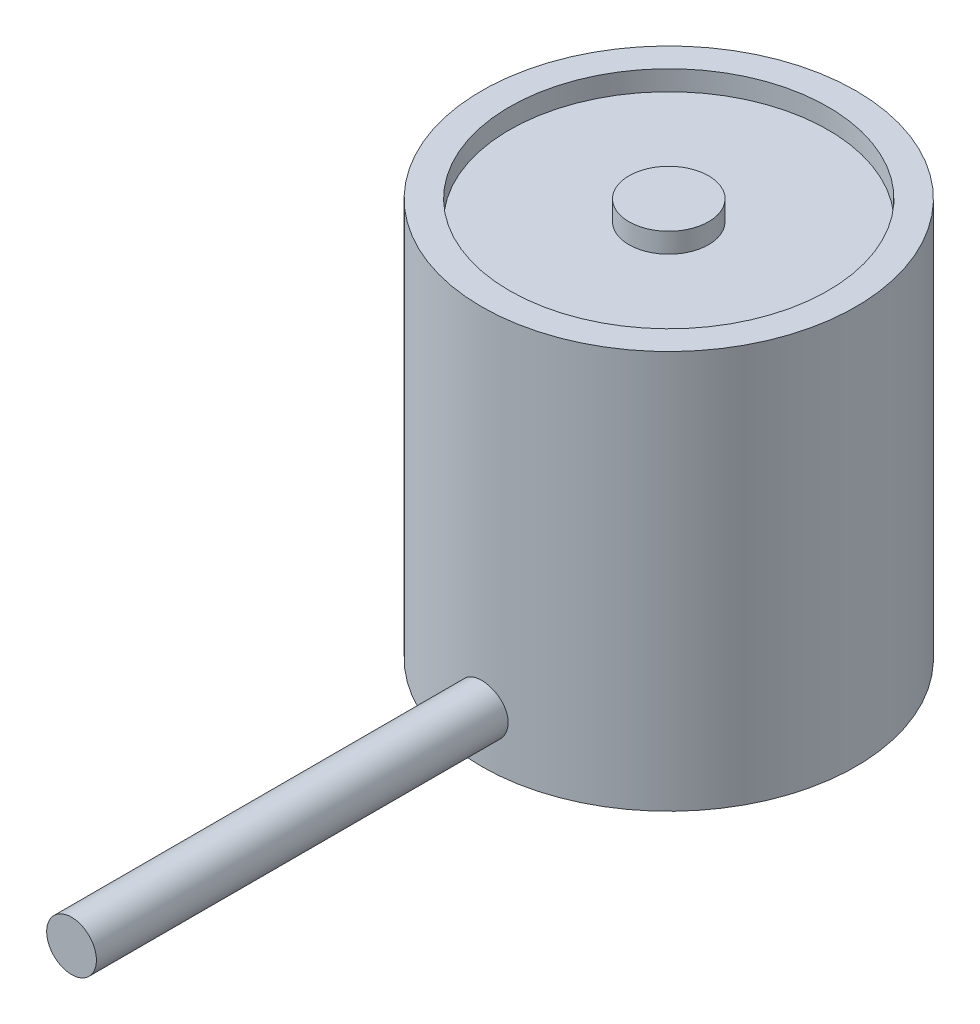
ISO-10303-21;
HEADER;
FILE_DESCRIPTION(('STEP AP214'),'2;1');
FILE_NAME('part.step','',(''),(''),'','','');
FILE_SCHEMA(('AUTOMOTIVE_DESIGN { 1 0 10303 214 1 1 1 1 }'));
ENDSEC;
DATA;
#1=APPLICATION_CONTEXT('core data for automotive mechanical design processes');
#2=APPLICATION_PROTOCOL_DEFINITION('international standard','automotive_design',2000,#1);
#3=PRODUCT_CONTEXT('',#1,'mechanical');
#4=PRODUCT('Part','Part','',(#3));
#5=PRODUCT_RELATED_PRODUCT_CATEGORY('part','',(#4));
#6=PRODUCT_DEFINITION_FORMATION('','',#4);
#7=PRODUCT_DEFINITION_CONTEXT('part definition',#1,'design');
#8=PRODUCT_DEFINITION('design','',#6,#7);
#9=PRODUCT_DEFINITION_SHAPE('','',#8);
#10=(LENGTH_UNIT() NAMED_UNIT(*) SI_UNIT(.MILLI.,.METRE.));
#11=(NAMED_UNIT(*) PLANE_ANGLE_UNIT() SI_UNIT($,.RADIAN.));
#12=(NAMED_UNIT(*) SI_UNIT($,.STERADIAN.) SOLID_ANGLE_UNIT());
#13=UNCERTAINTY_MEASURE_WITH_UNIT(LENGTH_MEASURE(1.E-05),#10,'distance_accuracy_value','');
#14=(GEOMETRIC_REPRESENTATION_CONTEXT(3) GLOBAL_UNCERTAINTY_ASSIGNED_CONTEXT((#13)) GLOBAL_UNIT_ASSIGNED_CONTEXT((#10,
#11,#12)) REPRESENTATION_CONTEXT('',''));
#15=CARTESIAN_POINT('',(0.,0.,0.));
#16=DIRECTION('',(0.,0.,1.));
#17=DIRECTION('',(1.,0.,0.));
#18=AXIS2_PLACEMENT_3D('',#15,#16,#17);
#19=CARTESIAN_POINT('',(0.,25.4,0.));
#20=DIRECTION('',(0.,-1.,0.));
#21=DIRECTION('',(0.,0.,-1.));
#22=AXIS2_PLACEMENT_3D('',#19,#20,#21);
#23=CYLINDRICAL_SURFACE('',#22,11.938);
#24=CARTESIAN_POINT('',(0.,0.,0.));
#25=DIRECTION('',(0.,1.,0.));
#26=DIRECTION('',(0.,0.,1.));
#27=AXIS2_PLACEMENT_3D('',#24,#25,#26);
#28=CIRCLE('',#27,11.938);
#29=CARTESIAN_POINT('',(0.,0.,11.938));
#30=VERTEX_POINT('',#29);
#31=EDGE_CURVE('E48',#30,#30,#28,.T.);
#32=ORIENTED_EDGE('',*,*,#31,.T.);
#33=EDGE_LOOP('',(#32));
#34=FACE_BOUND('',#33,.T.);
#35=CARTESIAN_POINT('',(0.,25.4,0.));
#36=DIRECTION('',(0.,1.,0.));
#37=DIRECTION('',(0.,0.,1.));
#38=AXIS2_PLACEMENT_3D('',#35,#36,#37);
#39=CIRCLE('',#38,11.938);
#40=CARTESIAN_POINT('',(0.,25.4,11.938));
#41=VERTEX_POINT('',#40);
#42=EDGE_CURVE('E44',#41,#41,#39,.T.);
#43=ORIENTED_EDGE('',*,*,#42,.F.);
#44=EDGE_LOOP('',(#43));
#45=FACE_BOUND('',#44,.T.);
#46=CARTESIAN_POINT('',(-1.5875,3.175,11.8319773389742));
#47=CARTESIAN_POINT('',(-1.58749625671006,3.08625341980781,11.8319786837634));
#48=CARTESIAN_POINT('',(-1.58003302450006,2.99745255330352,11.8329866023675));
#49=CARTESIAN_POINT('',(-1.55038065401625,2.82232558197894,11.8369074882707));
#50=CARTESIAN_POINT('',(-1.52817643487292,2.7360021061208,11.8398224064946));
#51=CARTESIAN_POINT('',(-1.46971123050861,2.5683906285289,11.8472214266479));
#52=CARTESIAN_POINT('',(-1.43346015889024,2.48709912229054,11.8517044216865));
#53=CARTESIAN_POINT('',(-1.34795218438454,2.33176718782083,11.8617331481919));
#54=CARTESIAN_POINT('',(-1.29869737448801,2.25772559532078,11.8672787085963));
#55=CARTESIAN_POINT('',(-1.18824714152815,2.11851347219376,11.8788469326889));
#56=CARTESIAN_POINT('',(-1.12698588551048,2.05339537620215,11.884872112828));
#57=CARTESIAN_POINT('',(-0.994403631835022,1.93433209173394,11.8966981154088));
#58=CARTESIAN_POINT('',(-0.92308211865717,1.88038747617245,11.9024989263337));
#59=CARTESIAN_POINT('',(-0.772072233468609,1.78501258544172,11.9132485474799));
#60=CARTESIAN_POINT('',(-0.692353463976678,1.74363003842184,11.9181940782982));
#61=CARTESIAN_POINT('',(-0.527020758814786,1.67485985501808,11.926648183858));
#62=CARTESIAN_POINT('',(-0.44140706975876,1.64747163358484,11.9301568186695));
#63=CARTESIAN_POINT('',(-0.267252401473817,1.60762496965444,11.9353240703601));
#64=CARTESIAN_POINT('',(-0.178731746471301,1.59507912415762,11.9369935137265));
#65=CARTESIAN_POINT('',(-0.000826881827132374,1.58500231236751,11.9383312945193));
#66=CARTESIAN_POINT('',(0.0885572894531452,1.58747068210815,11.9379997204357));
#67=CARTESIAN_POINT('',(0.265056741913584,1.60728250908834,11.9353815521462));
#68=CARTESIAN_POINT('',(0.352182784578739,1.62453195765965,11.9331073137049));
#69=CARTESIAN_POINT('',(0.522292464184642,1.67326915640209,11.926873177495));
#70=CARTESIAN_POINT('',(0.605276013696226,1.70475720694431,11.9229132441657));
#71=CARTESIAN_POINT('',(0.765034194319685,1.78117662635622,11.9137313610508));
#72=CARTESIAN_POINT('',(0.841789298301315,1.82614834508697,11.9085056325208));
#73=CARTESIAN_POINT('',(0.986698804701654,1.92822913665918,11.8973761461696));
#74=CARTESIAN_POINT('',(1.05485276071241,1.98533883906126,11.8914723531866));
#75=CARTESIAN_POINT('',(1.18117819949286,2.11060015752286,11.879592871574));
#76=CARTESIAN_POINT('',(1.23926840688346,2.17883375051047,11.8736169800274));
#77=CARTESIAN_POINT('',(1.34318481352508,2.32412527419903,11.86231172249));
#78=CARTESIAN_POINT('',(1.38901096461861,2.40118323954911,11.8569823590379));
#79=CARTESIAN_POINT('',(1.46710495326791,2.5620122085596,11.8475736982309));
#80=CARTESIAN_POINT('',(1.4993657295497,2.64578668146122,11.8434950522186));
#81=CARTESIAN_POINT('',(1.54933824116962,2.81763049723515,11.8370619537488));
#82=CARTESIAN_POINT('',(1.56705077369234,2.90569960449877,11.8347074068186));
#83=CARTESIAN_POINT('',(1.58731522403043,3.08291332528033,11.8320065841807));
#84=CARTESIAN_POINT('',(1.58998177053053,3.17204460811575,11.8316451245093));
#85=CARTESIAN_POINT('',(1.58038152007791,3.34948266545265,11.8329312000886));
#86=CARTESIAN_POINT('',(1.56811508454371,3.43778945985685,11.8345786867174));
#87=CARTESIAN_POINT('',(1.52909379907485,3.61072485121919,11.8396831428523));
#88=CARTESIAN_POINT('',(1.50239493405164,3.69536630497627,11.8431331185935));
#89=CARTESIAN_POINT('',(1.43532448271433,3.85897153318167,11.8514481319332));
#90=CARTESIAN_POINT('',(1.39495235659832,3.93793508332479,11.8563132253975));
#91=CARTESIAN_POINT('',(1.30140149621708,4.08846020958357,11.8669464974889));
#92=CARTESIAN_POINT('',(1.24814788090183,4.15997487331587,11.8727198848476));
#93=CARTESIAN_POINT('',(1.13045103964049,4.29309245210493,11.884503083741));
#94=CARTESIAN_POINT('',(1.06600731977801,4.35469492941959,11.8905129057026));
#95=CARTESIAN_POINT('',(0.92725761228045,4.46664483548646,11.902138711793));
#96=CARTESIAN_POINT('',(0.85289042454498,4.51691674665024,11.9077518915697));
#97=CARTESIAN_POINT('',(0.696700756801972,4.60425487754009,11.9179095509517));
#98=CARTESIAN_POINT('',(0.61487844379455,4.64132139298514,11.9224540544878));
#99=CARTESIAN_POINT('',(0.446347530652683,4.70107305056555,11.929949923559));
#100=CARTESIAN_POINT('',(0.359654372734604,4.72380112683981,11.9329060412786));
#101=CARTESIAN_POINT('',(0.183640288132136,4.75437020983065,11.9369118657015));
#102=CARTESIAN_POINT('',(0.0943194966080205,4.76221198091433,11.9379616702882));
#103=CARTESIAN_POINT('',(-0.0836785044035181,4.76277026085192,11.9380359680236));
#104=CARTESIAN_POINT('',(-0.172355365311753,4.75560293982991,11.9370760166638));
#105=CARTESIAN_POINT('',(-0.347231931012381,4.72659342079309,11.9332697085624));
#106=CARTESIAN_POINT('',(-0.433431639193436,4.70475124285399,11.9304233544013));
#107=CARTESIAN_POINT('',(-0.600886724851104,4.64704997022746,11.9231625713583));
#108=CARTESIAN_POINT('',(-0.682144312517136,4.61119719535155,11.9187488495564));
#109=CARTESIAN_POINT('',(-0.837508279725824,4.52650454603239,11.9088408733343));
#110=CARTESIAN_POINT('',(-0.911614529233625,4.47766443549727,11.9033465992715));
#111=CARTESIAN_POINT('',(-1.05116457082862,4.36795645602316,11.891839354891));
#112=CARTESIAN_POINT('',(-1.11654024680594,4.30700230728241,11.8858228490656));
#113=CARTESIAN_POINT('',(-1.23617935416954,4.17497693257802,11.8739769498469));
#114=CARTESIAN_POINT('',(-1.29044015897876,4.10390332197513,11.8681476009548));
#115=CARTESIAN_POINT('',(-1.38651574116563,3.95329680760551,11.8573088376264));
#116=CARTESIAN_POINT('',(-1.42827507675844,3.87372828404507,11.8523031187338));
#117=CARTESIAN_POINT('',(-1.4977779976606,3.70868334892528,11.8437216416871));
#118=CARTESIAN_POINT('',(-1.52553661845938,3.62321338763756,11.8401443503963));
#119=CARTESIAN_POINT('',(-1.55970729311636,3.47693147852757,11.8356808524551));
#120=CARTESIAN_POINT('',(-1.57011428829274,3.41703689860301,11.8342990834095));
#121=CARTESIAN_POINT('',(-1.58401189126012,3.29643668153848,11.8324468706574));
#122=CARTESIAN_POINT('',(-1.58750256160783,3.23573105173927,11.8319764187083));
#123=CARTESIAN_POINT('',(-1.5875,3.175,11.8319773389742));
#124=B_SPLINE_CURVE_WITH_KNOTS('',3,(#46,#47,#48,#49,#50,#51,#52,#53,#54,#55,#56,#57,#58,#59,
#60,#61,#62,#63,#64,#65,#66,#67,#68,#69,#70,#71,#72,#73,#74,#75,#76,#77,#78,#79,#80,#81,#82,#83,
#84,#85,#86,#87,#88,#89,#90,#91,#92,#93,#94,#95,#96,#97,#98,#99,#100,#101,#102,#103,#104,#105,
#106,#107,#108,#109,#110,#111,#112,#113,#114,#115,#116,#117,#118,#119,#120,#121,#122,#123),
.UNSPECIFIED.,.T.,.F.,(4,2,2,2,2,2,2,2,2,2,2,2,2,2,2,2,2,2,2,2,2,2,2,2,2,2,2,2,2,2,2,2,2,2,2,2,
2,2,4),(0.,0.266017846141124,0.532308263952564,0.798411087904837,1.06447110789082,1.33203298406,
1.5996085759479,1.86818842085806,2.13675703655036,2.40373612015177,2.6707033973577,
2.93598524089414,3.20127268095702,3.46736205420878,3.73346523208341,4.00162631495674,
4.26978845080779,4.5380900025795,4.80637685153641,5.0726169535714,5.33885061200467,
5.60405885648752,5.86927757225472,6.13607672792782,6.40288766275659,6.67142749173743,
6.9399613067131,7.20768717570436,7.4753992974035,7.74104699288908,8.00669432496018,
8.27222196856925,8.53775443943504,8.80525064975092,9.0728099998829,9.34153892465128,
9.60997864132657,9.79202159631247,9.97406290475027),.UNSPECIFIED.);
#125=CARTESIAN_POINT('',(-1.5875,3.175,11.8319773389742));
#126=VERTEX_POINT('',#125);
#127=EDGE_CURVE('E10',#126,#126,#124,.T.);
#128=ORIENTED_EDGE('',*,*,#127,.F.);
#129=EDGE_LOOP('',(#128));
#130=FACE_BOUND('',#129,.T.);
#131=ADVANCED_FACE('F34',(#34,#45,#130),#23,.T.);
#132=CARTESIAN_POINT('',(0.,25.4,0.));
#133=DIRECTION('',(0.,1.,0.));
#134=DIRECTION('',(0.,0.,1.));
#135=AXIS2_PLACEMENT_3D('',#132,#133,#134);
#136=PLANE('',#135);
#137=CARTESIAN_POINT('',(0.,25.4,0.));
#138=DIRECTION('',(0.,1.,0.));
#139=DIRECTION('',(0.,0.,1.));
#140=AXIS2_PLACEMENT_3D('',#137,#138,#139);
#141=CIRCLE('',#140,10.16);
#142=CARTESIAN_POINT('',(0.,25.4,10.16));
#143=VERTEX_POINT('',#142);
#144=EDGE_CURVE('E55',#143,#143,#141,.T.);
#145=ORIENTED_EDGE('',*,*,#144,.F.);
#146=EDGE_LOOP('',(#145));
#147=FACE_BOUND('',#146,.T.);
#148=ORIENTED_EDGE('',*,*,#42,.T.);
#149=EDGE_LOOP('',(#148));
#150=FACE_BOUND('',#149,.T.);
#151=ADVANCED_FACE('F83',(#147,#150),#136,.T.);
#152=CARTESIAN_POINT('',(0.,0.,0.));
#153=DIRECTION('',(0.,1.,0.));
#154=DIRECTION('',(0.,0.,1.));
#155=AXIS2_PLACEMENT_3D('',#152,#153,#154);
#156=PLANE('',#155);
#157=ORIENTED_EDGE('',*,*,#31,.F.);
#158=EDGE_LOOP('',(#157));
#159=FACE_BOUND('',#158,.T.);
#160=ADVANCED_FACE('F91',(#159),#156,.F.);
#161=CARTESIAN_POINT('',(0.,24.13,0.));
#162=DIRECTION('',(0.,1.,0.));
#163=DIRECTION('',(0.,0.,1.));
#164=AXIS2_PLACEMENT_3D('',#161,#162,#163);
#165=CYLINDRICAL_SURFACE('',#164,10.16);
#166=CARTESIAN_POINT('',(0.,24.13,0.));
#167=DIRECTION('',(0.,1.,0.));
#168=DIRECTION('',(0.,0.,1.));
#169=AXIS2_PLACEMENT_3D('',#166,#167,#168);
#170=CIRCLE('',#169,10.16);
#171=CARTESIAN_POINT('',(0.,24.13,10.16));
#172=VERTEX_POINT('',#171);
#173=EDGE_CURVE('E53',#172,#172,#170,.T.);
#174=ORIENTED_EDGE('',*,*,#173,.F.);
#175=EDGE_LOOP('',(#174));
#176=FACE_BOUND('',#175,.T.);
#177=ORIENTED_EDGE('',*,*,#144,.T.);
#178=EDGE_LOOP('',(#177));
#179=FACE_BOUND('',#178,.T.);
#180=ADVANCED_FACE('F98',(#176,#179),#165,.F.);
#181=CARTESIAN_POINT('',(0.,24.13,0.));
#182=DIRECTION('',(0.,1.,0.));
#183=DIRECTION('',(0.,0.,1.));
#184=AXIS2_PLACEMENT_3D('',#181,#182,#183);
#185=PLANE('',#184);
#186=CARTESIAN_POINT('',(0.,24.13,0.));
#187=DIRECTION('',(0.,1.,0.));
#188=DIRECTION('',(0.,0.,1.));
#189=AXIS2_PLACEMENT_3D('',#186,#187,#188);
#190=CIRCLE('',#189,2.54);
#191=CARTESIAN_POINT('',(0.,24.13,2.54));
#192=VERTEX_POINT('',#191);
#193=EDGE_CURVE('E58',#192,#192,#190,.T.);
#194=ORIENTED_EDGE('',*,*,#193,.F.);
#195=EDGE_LOOP('',(#194));
#196=FACE_BOUND('',#195,.T.);
#197=ORIENTED_EDGE('',*,*,#173,.T.);
#198=EDGE_LOOP('',(#197));
#199=FACE_BOUND('',#198,.T.);
#200=ADVANCED_FACE('F102',(#196,#199),#185,.T.);
#201=CARTESIAN_POINT('',(0.,24.13,0.));
#202=DIRECTION('',(0.,1.,0.));
#203=DIRECTION('',(0.,0.,1.));
#204=AXIS2_PLACEMENT_3D('',#201,#202,#203);
#205=CYLINDRICAL_SURFACE('',#204,2.54);
#206=ORIENTED_EDGE('',*,*,#193,.T.);
#207=EDGE_LOOP('',(#206));
#208=FACE_BOUND('',#207,.T.);
#209=CARTESIAN_POINT('',(0.,25.4,0.));
#210=DIRECTION('',(0.,1.,0.));
#211=DIRECTION('',(0.,0.,1.));
#212=AXIS2_PLACEMENT_3D('',#209,#210,#211);
#213=CIRCLE('',#212,2.54);
#214=CARTESIAN_POINT('',(0.,25.4,2.54));
#215=VERTEX_POINT('',#214);
#216=EDGE_CURVE('E61',#215,#215,#213,.T.);
#217=ORIENTED_EDGE('',*,*,#216,.F.);
#218=EDGE_LOOP('',(#217));
#219=FACE_BOUND('',#218,.T.);
#220=ADVANCED_FACE('F80',(#208,#219),#205,.T.);
#221=ORIENTED_EDGE('',*,*,#216,.T.);
#222=EDGE_LOOP('',(#221));
#223=FACE_BOUND('',#222,.T.);
#224=ADVANCED_FACE('F74',(#223),#136,.T.);
#225=CARTESIAN_POINT('',(0.,3.175,38.1));
#226=DIRECTION('',(0.,0.,-1.));
#227=DIRECTION('',(-1.,0.,0.));
#228=AXIS2_PLACEMENT_3D('',#225,#226,#227);
#229=CYLINDRICAL_SURFACE('',#228,1.5875);
#230=CARTESIAN_POINT('',(0.,3.175,38.1));
#231=DIRECTION('',(0.,0.,1.));
#232=DIRECTION('',(1.,0.,0.));
#233=AXIS2_PLACEMENT_3D('',#230,#231,#232);
#234=CIRCLE('',#233,1.5875);
#235=CARTESIAN_POINT('',(1.5875,3.175,38.1));
#236=VERTEX_POINT('',#235);
#237=EDGE_CURVE('E64',#236,#236,#234,.T.);
#238=ORIENTED_EDGE('',*,*,#237,.F.);
#239=EDGE_LOOP('',(#238));
#240=FACE_BOUND('',#239,.T.);
#241=ORIENTED_EDGE('',*,*,#127,.T.);
#242=EDGE_LOOP('',(#241));
#243=FACE_BOUND('',#242,.T.);
#244=ADVANCED_FACE('F72',(#240,#243),#229,.T.);
#245=CARTESIAN_POINT('',(0.,3.175,38.1));
#246=DIRECTION('',(0.,0.,1.));
#247=DIRECTION('',(1.,0.,0.));
#248=AXIS2_PLACEMENT_3D('',#245,#246,#247);
#249=PLANE('',#248);
#250=ORIENTED_EDGE('',*,*,#237,.T.);
#251=EDGE_LOOP('',(#250));
#252=FACE_BOUND('',#251,.T.);
#253=ADVANCED_FACE('F70',(#252),#249,.T.);
#254=CLOSED_SHELL('',(#131,#151,#160,#180,#200,#220,#224,#244,#253));
#255=MANIFOLD_SOLID_BREP('B2',#254);
#256=ADVANCED_BREP_SHAPE_REPRESENTATION('',(#18,#255),#14);
#257=SHAPE_DEFINITION_REPRESENTATION(#9,#256);
ENDSEC;
END-ISO-10303-21;
